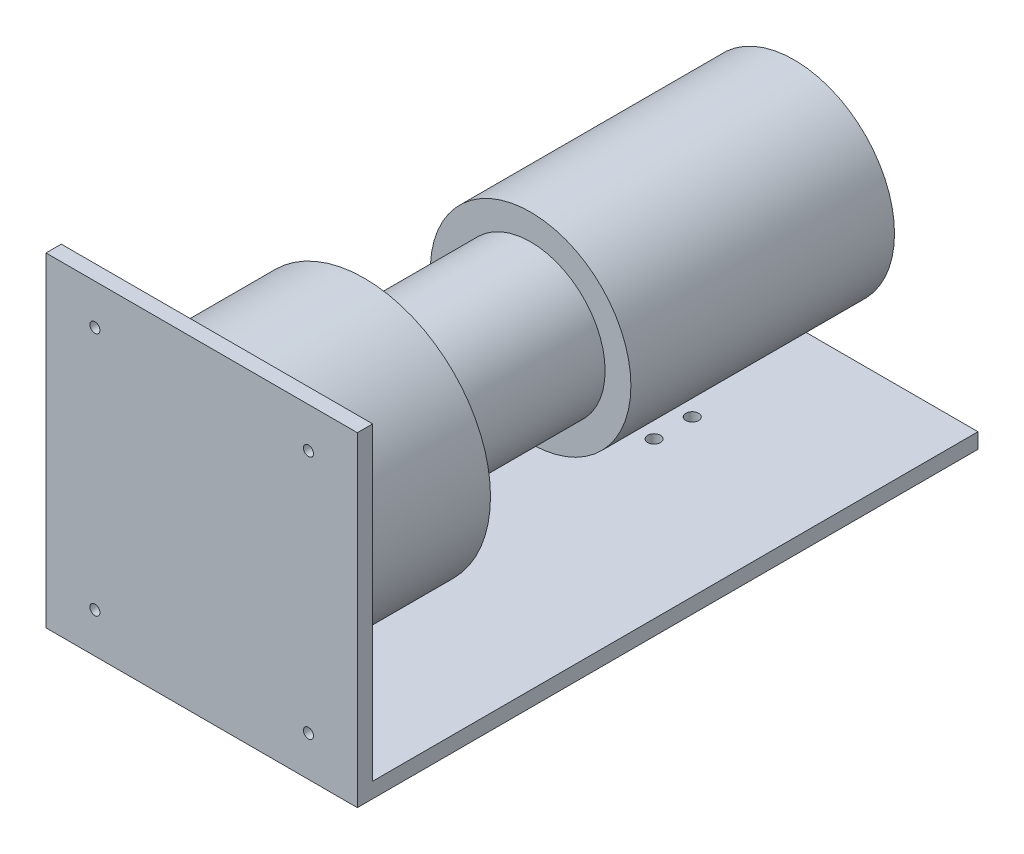
ISO-10303-21;
HEADER;
FILE_DESCRIPTION(('STEP AP214'),'2;1');
FILE_NAME('part.step','',(''),(''),'','','');
FILE_SCHEMA(('AUTOMOTIVE_DESIGN { 1 0 10303 214 1 1 1 1 }'));
ENDSEC;
DATA;
#1=APPLICATION_CONTEXT('core data for automotive mechanical design processes');
#2=APPLICATION_PROTOCOL_DEFINITION('international standard','automotive_design',2000,#1);
#3=PRODUCT_CONTEXT('',#1,'mechanical');
#4=PRODUCT('Part','Part','',(#3));
#5=PRODUCT_RELATED_PRODUCT_CATEGORY('part','',(#4));
#6=PRODUCT_DEFINITION_FORMATION('','',#4);
#7=PRODUCT_DEFINITION_CONTEXT('part definition',#1,'design');
#8=PRODUCT_DEFINITION('design','',#6,#7);
#9=PRODUCT_DEFINITION_SHAPE('','',#8);
#10=(LENGTH_UNIT() NAMED_UNIT(*) SI_UNIT(.MILLI.,.METRE.));
#11=(NAMED_UNIT(*) PLANE_ANGLE_UNIT() SI_UNIT($,.RADIAN.));
#12=(NAMED_UNIT(*) SI_UNIT($,.STERADIAN.) SOLID_ANGLE_UNIT());
#13=UNCERTAINTY_MEASURE_WITH_UNIT(LENGTH_MEASURE(1.E-05),#10,'distance_accuracy_value','');
#14=(GEOMETRIC_REPRESENTATION_CONTEXT(3) GLOBAL_UNCERTAINTY_ASSIGNED_CONTEXT((#13)) GLOBAL_UNIT_ASSIGNED_CONTEXT((#10,
#11,#12)) REPRESENTATION_CONTEXT('',''));
#15=CARTESIAN_POINT('',(0.,0.,0.));
#16=DIRECTION('',(0.,0.,1.));
#17=DIRECTION('',(1.,0.,0.));
#18=AXIS2_PLACEMENT_3D('',#15,#16,#17);
#19=CARTESIAN_POINT('',(0.,0.,80.));
#20=DIRECTION('',(0.,0.,-1.));
#21=DIRECTION('',(-1.,0.,0.));
#22=AXIS2_PLACEMENT_3D('',#19,#20,#21);
#23=CYLINDRICAL_SURFACE('',#22,66.);
#24=CARTESIAN_POINT('',(0.,0.,0.));
#25=DIRECTION('',(0.,0.,1.));
#26=DIRECTION('',(1.,0.,0.));
#27=AXIS2_PLACEMENT_3D('',#24,#25,#26);
#28=CIRCLE('',#27,66.);
#29=CARTESIAN_POINT('',(66.,0.,0.));
#30=VERTEX_POINT('',#29);
#31=EDGE_CURVE('E46',#30,#30,#28,.T.);
#32=ORIENTED_EDGE('',*,*,#31,.T.);
#33=EDGE_LOOP('',(#32));
#34=FACE_BOUND('',#33,.T.);
#35=CARTESIAN_POINT('',(0.,0.,77.1921931565536));
#36=DIRECTION('',(0.,0.,1.));
#37=DIRECTION('',(0.,-1.,0.));
#38=AXIS2_PLACEMENT_3D('',#35,#36,#37);
#39=CIRCLE('',#38,66.);
#40=CARTESIAN_POINT('',(0.,-66.,77.1921931565536));
#41=VERTEX_POINT('',#40);
#42=EDGE_CURVE('E11',#41,#41,#39,.T.);
#43=ORIENTED_EDGE('',*,*,#42,.F.);
#44=EDGE_LOOP('',(#43));
#45=FACE_BOUND('',#44,.T.);
#46=ADVANCED_FACE('F37',(#34,#45),#23,.T.);
#47=CARTESIAN_POINT('',(0.,0.,0.));
#48=DIRECTION('',(0.,0.,1.));
#49=DIRECTION('',(1.,0.,0.));
#50=AXIS2_PLACEMENT_3D('',#47,#48,#49);
#51=PLANE('',#50);
#52=CARTESIAN_POINT('',(0.,0.,0.));
#53=DIRECTION('',(0.,0.,1.));
#54=DIRECTION('',(1.,0.,0.));
#55=AXIS2_PLACEMENT_3D('',#52,#53,#54);
#56=CIRCLE('',#55,39.);
#57=CARTESIAN_POINT('',(39.,0.,0.));
#58=VERTEX_POINT('',#57);
#59=EDGE_CURVE('E153',#58,#58,#56,.T.);
#60=ORIENTED_EDGE('',*,*,#59,.T.);
#61=EDGE_LOOP('',(#60));
#62=FACE_BOUND('',#61,.T.);
#63=ORIENTED_EDGE('',*,*,#31,.F.);
#64=EDGE_LOOP('',(#63));
#65=FACE_BOUND('',#64,.T.);
#66=ADVANCED_FACE('F208',(#62,#65),#51,.F.);
#67=CARTESIAN_POINT('',(0.,0.,-87.));
#68=DIRECTION('',(0.,0.,1.));
#69=DIRECTION('',(1.,0.,0.));
#70=AXIS2_PLACEMENT_3D('',#67,#68,#69);
#71=CYLINDRICAL_SURFACE('',#70,39.);
#72=CARTESIAN_POINT('',(0.,0.,-87.));
#73=DIRECTION('',(0.,0.,1.));
#74=DIRECTION('',(1.,0.,0.));
#75=AXIS2_PLACEMENT_3D('',#72,#73,#74);
#76=CIRCLE('',#75,39.);
#77=CARTESIAN_POINT('',(39.,0.,-87.));
#78=VERTEX_POINT('',#77);
#79=EDGE_CURVE('E148',#78,#78,#76,.T.);
#80=ORIENTED_EDGE('',*,*,#79,.T.);
#81=EDGE_LOOP('',(#80));
#82=FACE_BOUND('',#81,.T.);
#83=ORIENTED_EDGE('',*,*,#59,.F.);
#84=EDGE_LOOP('',(#83));
#85=FACE_BOUND('',#84,.T.);
#86=ADVANCED_FACE('F213',(#82,#85),#71,.T.);
#87=CARTESIAN_POINT('',(0.,0.,-225.));
#88=DIRECTION('',(0.,0.,1.));
#89=DIRECTION('',(1.,0.,0.));
#90=AXIS2_PLACEMENT_3D('',#87,#88,#89);
#91=CYLINDRICAL_SURFACE('',#90,52.5);
#92=CARTESIAN_POINT('',(0.,0.,-225.));
#93=DIRECTION('',(0.,0.,1.));
#94=DIRECTION('',(1.,0.,0.));
#95=AXIS2_PLACEMENT_3D('',#92,#93,#94);
#96=CIRCLE('',#95,52.5);
#97=CARTESIAN_POINT('',(52.5,0.,-225.));
#98=VERTEX_POINT('',#97);
#99=EDGE_CURVE('E145',#98,#98,#96,.T.);
#100=ORIENTED_EDGE('',*,*,#99,.T.);
#101=EDGE_LOOP('',(#100));
#102=FACE_BOUND('',#101,.T.);
#103=CARTESIAN_POINT('',(0.,0.,-87.));
#104=DIRECTION('',(0.,0.,1.));
#105=DIRECTION('',(1.,0.,0.));
#106=AXIS2_PLACEMENT_3D('',#103,#104,#105);
#107=CIRCLE('',#106,52.5);
#108=CARTESIAN_POINT('',(52.5,0.,-87.));
#109=VERTEX_POINT('',#108);
#110=EDGE_CURVE('E144',#109,#109,#107,.T.);
#111=ORIENTED_EDGE('',*,*,#110,.F.);
#112=EDGE_LOOP('',(#111));
#113=FACE_BOUND('',#112,.T.);
#114=ADVANCED_FACE('F235',(#102,#113),#91,.T.);
#115=CARTESIAN_POINT('',(0.,0.,-225.));
#116=DIRECTION('',(0.,0.,1.));
#117=DIRECTION('',(1.,0.,0.));
#118=AXIS2_PLACEMENT_3D('',#115,#116,#117);
#119=PLANE('',#118);
#120=ORIENTED_EDGE('',*,*,#99,.F.);
#121=EDGE_LOOP('',(#120));
#122=FACE_BOUND('',#121,.T.);
#123=ADVANCED_FACE('F228',(#122),#119,.F.);
#124=CARTESIAN_POINT('',(0.,0.,-87.));
#125=DIRECTION('',(0.,0.,1.));
#126=DIRECTION('',(1.,0.,0.));
#127=AXIS2_PLACEMENT_3D('',#124,#125,#126);
#128=PLANE('',#127);
#129=ORIENTED_EDGE('',*,*,#79,.F.);
#130=EDGE_LOOP('',(#129));
#131=FACE_BOUND('',#130,.T.);
#132=ORIENTED_EDGE('',*,*,#110,.T.);
#133=EDGE_LOOP('',(#132));
#134=FACE_BOUND('',#133,.T.);
#135=ADVANCED_FACE('F220',(#131,#134),#128,.T.);
#136=CARTESIAN_POINT('',(81.5,-82.6989064125037,77.1921931565536));
#137=DIRECTION('',(0.,0.,1.));
#138=DIRECTION('',(0.,-1.,0.));
#139=AXIS2_PLACEMENT_3D('',#136,#137,#138);
#140=PLANE('',#139);
#141=CARTESIAN_POINT('',(-55.9,-69.6989064125036,77.1921931565536));
#142=DIRECTION('',(0.,0.,1.));
#143=DIRECTION('',(0.,-1.,0.));
#144=AXIS2_PLACEMENT_3D('',#141,#142,#143);
#145=CIRCLE('',#144,2.625);
#146=CARTESIAN_POINT('',(-55.9,-72.3239064125036,77.1921931565536));
#147=VERTEX_POINT('',#146);
#148=EDGE_CURVE('E128',#147,#147,#145,.T.);
#149=ORIENTED_EDGE('',*,*,#148,.T.);
#150=EDGE_LOOP('',(#149));
#151=FACE_BOUND('',#150,.T.);
#152=CARTESIAN_POINT('',(55.9,-69.6989064125036,77.1921931565536));
#153=DIRECTION('',(0.,0.,1.));
#154=DIRECTION('',(0.,-1.,0.));
#155=AXIS2_PLACEMENT_3D('',#152,#153,#154);
#156=CIRCLE('',#155,2.625);
#157=CARTESIAN_POINT('',(55.9,-72.3239064125036,77.1921931565536));
#158=VERTEX_POINT('',#157);
#159=EDGE_CURVE('E168',#158,#158,#156,.T.);
#160=ORIENTED_EDGE('',*,*,#159,.T.);
#161=EDGE_LOOP('',(#160));
#162=FACE_BOUND('',#161,.T.);
#163=CARTESIAN_POINT('',(55.9,58.3010935874964,77.1921931565536));
#164=DIRECTION('',(0.,0.,1.));
#165=DIRECTION('',(0.,-1.,0.));
#166=AXIS2_PLACEMENT_3D('',#163,#164,#165);
#167=CIRCLE('',#166,2.625);
#168=CARTESIAN_POINT('',(55.9,55.6760935874964,77.1921931565536));
#169=VERTEX_POINT('',#168);
#170=EDGE_CURVE('E165',#169,#169,#167,.T.);
#171=ORIENTED_EDGE('',*,*,#170,.T.);
#172=EDGE_LOOP('',(#171));
#173=FACE_BOUND('',#172,.T.);
#174=CARTESIAN_POINT('',(-55.9,58.3010935874964,77.1921931565536));
#175=DIRECTION('',(0.,0.,1.));
#176=DIRECTION('',(0.,-1.,0.));
#177=AXIS2_PLACEMENT_3D('',#174,#175,#176);
#178=CIRCLE('',#177,2.625);
#179=CARTESIAN_POINT('',(-55.9,55.6760935874964,77.1921931565536));
#180=VERTEX_POINT('',#179);
#181=EDGE_CURVE('E161',#180,#180,#178,.T.);
#182=ORIENTED_EDGE('',*,*,#181,.T.);
#183=EDGE_LOOP('',(#182));
#184=FACE_BOUND('',#183,.T.);
#185=ORIENTED_EDGE('',*,*,#42,.T.);
#186=EDGE_LOOP('',(#185));
#187=FACE_BOUND('',#186,.T.);
#188=DIRECTION('',(0.,1.,0.));
#189=VECTOR('',#188,1.);
#190=CARTESIAN_POINT('',(-81.5,-82.6989064125037,77.1921931565536));
#191=LINE('',#190,#189);
#192=CARTESIAN_POINT('',(-81.5,-82.6989064125037,77.1921931565536));
#193=VERTEX_POINT('',#192);
#194=CARTESIAN_POINT('',(-81.5,79.3010935874964,77.1921931565536));
#195=VERTEX_POINT('',#194);
#196=EDGE_CURVE('E124',#193,#195,#191,.T.);
#197=ORIENTED_EDGE('',*,*,#196,.T.);
#198=DIRECTION('',(-1.,0.,0.));
#199=VECTOR('',#198,1.);
#200=CARTESIAN_POINT('',(81.5,79.3010935874964,77.1921931565536));
#201=LINE('',#200,#199);
#202=CARTESIAN_POINT('',(81.5,79.3010935874964,77.1921931565536));
#203=VERTEX_POINT('',#202);
#204=EDGE_CURVE('E142',#203,#195,#201,.T.);
#205=ORIENTED_EDGE('',*,*,#204,.F.);
#206=DIRECTION('',(0.,1.,0.));
#207=VECTOR('',#206,1.);
#208=CARTESIAN_POINT('',(81.5,-82.6989064125037,77.1921931565536));
#209=LINE('',#208,#207);
#210=CARTESIAN_POINT('',(81.5,-82.6989064125037,77.1921931565536));
#211=VERTEX_POINT('',#210);
#212=EDGE_CURVE('E135',#211,#203,#209,.T.);
#213=ORIENTED_EDGE('',*,*,#212,.F.);
#214=DIRECTION('',(-1.,0.,0.));
#215=VECTOR('',#214,1.);
#216=CARTESIAN_POINT('',(81.5,-82.6989064125037,77.1921931565536));
#217=LINE('',#216,#215);
#218=EDGE_CURVE('E120',#211,#193,#217,.T.);
#219=ORIENTED_EDGE('',*,*,#218,.T.);
#220=EDGE_LOOP('',(#197,#205,#213,#219));
#221=FACE_BOUND('',#220,.T.);
#222=ADVANCED_FACE('F193',(#151,#162,#173,#184,#187,#221),#140,.F.);
#223=CARTESIAN_POINT('',(81.5,79.3010935874964,77.1921931565536));
#224=DIRECTION('',(0.,-1.,0.));
#225=DIRECTION('',(0.,0.,-1.));
#226=AXIS2_PLACEMENT_3D('',#223,#224,#225);
#227=PLANE('',#226);
#228=DIRECTION('',(0.,0.,1.));
#229=VECTOR('',#228,1.);
#230=CARTESIAN_POINT('',(-81.5,79.3010935874964,77.1921931565536));
#231=LINE('',#230,#229);
#232=CARTESIAN_POINT('',(-81.5,79.3010935874964,85.1921931565536));
#233=VERTEX_POINT('',#232);
#234=EDGE_CURVE('E127',#195,#233,#231,.T.);
#235=ORIENTED_EDGE('',*,*,#234,.T.);
#236=DIRECTION('',(-1.,0.,0.));
#237=VECTOR('',#236,1.);
#238=CARTESIAN_POINT('',(81.5,79.3010935874964,85.1921931565536));
#239=LINE('',#238,#237);
#240=CARTESIAN_POINT('',(81.5,79.3010935874964,85.1921931565536));
#241=VERTEX_POINT('',#240);
#242=EDGE_CURVE('E139',#241,#233,#239,.T.);
#243=ORIENTED_EDGE('',*,*,#242,.F.);
#244=DIRECTION('',(0.,0.,1.));
#245=VECTOR('',#244,1.);
#246=CARTESIAN_POINT('',(81.5,79.3010935874964,77.1921931565536));
#247=LINE('',#246,#245);
#248=EDGE_CURVE('E93',#203,#241,#247,.T.);
#249=ORIENTED_EDGE('',*,*,#248,.F.);
#250=ORIENTED_EDGE('',*,*,#204,.T.);
#251=EDGE_LOOP('',(#235,#243,#249,#250));
#252=FACE_BOUND('',#251,.T.);
#253=ADVANCED_FACE('F185',(#252),#227,.F.);
#254=CARTESIAN_POINT('',(81.5,79.3010935874964,85.1921931565536));
#255=DIRECTION('',(0.,0.,-1.));
#256=DIRECTION('',(0.,1.,0.));
#257=AXIS2_PLACEMENT_3D('',#254,#255,#256);
#258=PLANE('',#257);
#259=CARTESIAN_POINT('',(-55.9,-69.6989064125036,85.1921931565536));
#260=DIRECTION('',(0.,0.,-1.));
#261=DIRECTION('',(0.,1.,0.));
#262=AXIS2_PLACEMENT_3D('',#259,#260,#261);
#263=CIRCLE('',#262,2.625);
#264=CARTESIAN_POINT('',(-55.9,-67.0739064125036,85.1921931565536));
#265=VERTEX_POINT('',#264);
#266=EDGE_CURVE('E40',#265,#265,#263,.T.);
#267=ORIENTED_EDGE('',*,*,#266,.T.);
#268=EDGE_LOOP('',(#267));
#269=FACE_BOUND('',#268,.T.);
#270=CARTESIAN_POINT('',(55.9,-69.6989064125036,85.1921931565536));
#271=DIRECTION('',(0.,0.,-1.));
#272=DIRECTION('',(0.,1.,0.));
#273=AXIS2_PLACEMENT_3D('',#270,#271,#272);
#274=CIRCLE('',#273,2.625);
#275=CARTESIAN_POINT('',(55.9,-67.0739064125036,85.1921931565536));
#276=VERTEX_POINT('',#275);
#277=EDGE_CURVE('E166',#276,#276,#274,.T.);
#278=ORIENTED_EDGE('',*,*,#277,.T.);
#279=EDGE_LOOP('',(#278));
#280=FACE_BOUND('',#279,.T.);
#281=CARTESIAN_POINT('',(55.9,58.3010935874964,85.1921931565536));
#282=DIRECTION('',(0.,0.,-1.));
#283=DIRECTION('',(0.,1.,0.));
#284=AXIS2_PLACEMENT_3D('',#281,#282,#283);
#285=CIRCLE('',#284,2.625);
#286=CARTESIAN_POINT('',(55.9,60.9260935874964,85.1921931565536));
#287=VERTEX_POINT('',#286);
#288=EDGE_CURVE('E163',#287,#287,#285,.T.);
#289=ORIENTED_EDGE('',*,*,#288,.T.);
#290=EDGE_LOOP('',(#289));
#291=FACE_BOUND('',#290,.T.);
#292=CARTESIAN_POINT('',(-55.9,58.3010935874964,85.1921931565536));
#293=DIRECTION('',(0.,0.,-1.));
#294=DIRECTION('',(0.,1.,0.));
#295=AXIS2_PLACEMENT_3D('',#292,#293,#294);
#296=CIRCLE('',#295,2.625);
#297=CARTESIAN_POINT('',(-55.9,60.9260935874964,85.1921931565536));
#298=VERTEX_POINT('',#297);
#299=EDGE_CURVE('E158',#298,#298,#296,.T.);
#300=ORIENTED_EDGE('',*,*,#299,.T.);
#301=EDGE_LOOP('',(#300));
#302=FACE_BOUND('',#301,.T.);
#303=DIRECTION('',(0.,-1.,0.));
#304=VECTOR('',#303,1.);
#305=CARTESIAN_POINT('',(-81.5,79.3010935874964,85.1921931565536));
#306=LINE('',#305,#304);
#307=CARTESIAN_POINT('',(-81.5,-90.6989064125036,85.1921931565536));
#308=VERTEX_POINT('',#307);
#309=EDGE_CURVE('E130',#233,#308,#306,.T.);
#310=ORIENTED_EDGE('',*,*,#309,.T.);
#311=DIRECTION('',(-1.,0.,0.));
#312=VECTOR('',#311,1.);
#313=CARTESIAN_POINT('',(81.5,-90.6989064125036,85.1921931565536));
#314=LINE('',#313,#312);
#315=CARTESIAN_POINT('',(81.5,-90.6989064125036,85.1921931565536));
#316=VERTEX_POINT('',#315);
#317=EDGE_CURVE('E115',#316,#308,#314,.T.);
#318=ORIENTED_EDGE('',*,*,#317,.F.);
#319=DIRECTION('',(0.,-1.,0.));
#320=VECTOR('',#319,1.);
#321=CARTESIAN_POINT('',(81.5,79.3010935874964,85.1921931565536));
#322=LINE('',#321,#320);
#323=EDGE_CURVE('E106',#241,#316,#322,.T.);
#324=ORIENTED_EDGE('',*,*,#323,.F.);
#325=ORIENTED_EDGE('',*,*,#242,.T.);
#326=EDGE_LOOP('',(#310,#318,#324,#325));
#327=FACE_BOUND('',#326,.T.);
#328=ADVANCED_FACE('F188',(#269,#280,#291,#302,#327),#258,.F.);
#329=CARTESIAN_POINT('',(81.5,-90.6989064125036,85.1921931565536));
#330=DIRECTION('',(0.,1.,0.));
#331=DIRECTION('',(0.,0.,1.));
#332=AXIS2_PLACEMENT_3D('',#329,#330,#331);
#333=PLANE('',#332);
#334=CARTESIAN_POINT('',(-1.30828681222091E-12,-90.6989064125197,-151.628034649166));
#335=DIRECTION('',(0.,1.,0.));
#336=DIRECTION('',(0.,0.,1.));
#337=AXIS2_PLACEMENT_3D('',#334,#335,#336);
#338=CIRCLE('',#337,3.34999999999998);
#339=CARTESIAN_POINT('',(-1.30828681222091E-12,-90.6989064125197,-148.278034649166));
#340=VERTEX_POINT('',#339);
#341=EDGE_CURVE('E162',#340,#340,#338,.T.);
#342=ORIENTED_EDGE('',*,*,#341,.T.);
#343=EDGE_LOOP('',(#342));
#344=FACE_BOUND('',#343,.T.);
#345=CARTESIAN_POINT('',(-1.30828681222091E-12,-90.6989064125197,-171.628034649166));
#346=DIRECTION('',(0.,1.,0.));
#347=DIRECTION('',(0.,0.,1.));
#348=AXIS2_PLACEMENT_3D('',#345,#346,#347);
#349=CIRCLE('',#348,3.34999999999998);
#350=CARTESIAN_POINT('',(-1.30828681222091E-12,-90.6989064125197,-168.278034649166));
#351=VERTEX_POINT('',#350);
#352=EDGE_CURVE('E422',#351,#351,#349,.T.);
#353=ORIENTED_EDGE('',*,*,#352,.T.);
#354=EDGE_LOOP('',(#353));
#355=FACE_BOUND('',#354,.T.);
#356=DIRECTION('',(0.,0.,-1.));
#357=VECTOR('',#356,1.);
#358=CARTESIAN_POINT('',(-81.5,-90.6989064125036,85.1921931565536));
#359=LINE('',#358,#357);
#360=CARTESIAN_POINT('',(-81.5,-90.6989064125036,-239.70794933244));
#361=VERTEX_POINT('',#360);
#362=EDGE_CURVE('E114',#308,#361,#359,.T.);
#363=ORIENTED_EDGE('',*,*,#362,.T.);
#364=DIRECTION('',(-1.,0.,0.));
#365=VECTOR('',#364,1.);
#366=CARTESIAN_POINT('',(81.5,-90.6989064125036,-239.70794933244));
#367=LINE('',#366,#365);
#368=CARTESIAN_POINT('',(81.5,-90.6989064125036,-239.70794933244));
#369=VERTEX_POINT('',#368);
#370=EDGE_CURVE('E111',#369,#361,#367,.T.);
#371=ORIENTED_EDGE('',*,*,#370,.F.);
#372=DIRECTION('',(0.,0.,-1.));
#373=VECTOR('',#372,1.);
#374=CARTESIAN_POINT('',(81.5,-90.6989064125036,85.1921931565536));
#375=LINE('',#374,#373);
#376=EDGE_CURVE('E100',#316,#369,#375,.T.);
#377=ORIENTED_EDGE('',*,*,#376,.F.);
#378=ORIENTED_EDGE('',*,*,#317,.T.);
#379=EDGE_LOOP('',(#363,#371,#377,#378));
#380=FACE_BOUND('',#379,.T.);
#381=ADVANCED_FACE('F112',(#344,#355,#380),#333,.F.);
#382=CARTESIAN_POINT('',(81.5,-90.6989064125036,-239.70794933244));
#383=DIRECTION('',(0.,0.,1.));
#384=DIRECTION('',(1.,0.,0.));
#385=AXIS2_PLACEMENT_3D('',#382,#383,#384);
#386=PLANE('',#385);
#387=DIRECTION('',(0.,1.,0.));
#388=VECTOR('',#387,1.);
#389=CARTESIAN_POINT('',(-81.5,-90.6989064125036,-239.70794933244));
#390=LINE('',#389,#388);
#391=CARTESIAN_POINT('',(-81.5,-82.6989064125036,-239.70794933244));
#392=VERTEX_POINT('',#391);
#393=EDGE_CURVE('E78',#361,#392,#390,.T.);
#394=ORIENTED_EDGE('',*,*,#393,.T.);
#395=DIRECTION('',(-1.,0.,0.));
#396=VECTOR('',#395,1.);
#397=CARTESIAN_POINT('',(81.5,-82.6989064125036,-239.70794933244));
#398=LINE('',#397,#396);
#399=CARTESIAN_POINT('',(81.5,-82.6989064125036,-239.70794933244));
#400=VERTEX_POINT('',#399);
#401=EDGE_CURVE('E116',#400,#392,#398,.T.);
#402=ORIENTED_EDGE('',*,*,#401,.F.);
#403=DIRECTION('',(0.,1.,0.));
#404=VECTOR('',#403,1.);
#405=CARTESIAN_POINT('',(81.5,-90.6989064125036,-239.70794933244));
#406=LINE('',#405,#404);
#407=EDGE_CURVE('E104',#369,#400,#406,.T.);
#408=ORIENTED_EDGE('',*,*,#407,.F.);
#409=ORIENTED_EDGE('',*,*,#370,.T.);
#410=EDGE_LOOP('',(#394,#402,#408,#409));
#411=FACE_BOUND('',#410,.T.);
#412=ADVANCED_FACE('F118',(#411),#386,.F.);
#413=CARTESIAN_POINT('',(81.5,-82.6989064125036,-239.70794933244));
#414=DIRECTION('',(0.,-1.,0.));
#415=DIRECTION('',(0.,0.,-1.));
#416=AXIS2_PLACEMENT_3D('',#413,#414,#415);
#417=PLANE('',#416);
#418=CARTESIAN_POINT('',(0.,-82.6989064125036,-151.628034649166));
#419=DIRECTION('',(0.,1.,0.));
#420=DIRECTION('',(0.,0.,1.));
#421=AXIS2_PLACEMENT_3D('',#418,#419,#420);
#422=CIRCLE('',#421,3.34999999999998);
#423=CARTESIAN_POINT('',(0.,-82.6989064125036,-148.278034649166));
#424=VERTEX_POINT('',#423);
#425=EDGE_CURVE('E417',#424,#424,#422,.T.);
#426=ORIENTED_EDGE('',*,*,#425,.F.);
#427=EDGE_LOOP('',(#426));
#428=FACE_BOUND('',#427,.T.);
#429=CARTESIAN_POINT('',(0.,-82.6989064125036,-171.628034649166));
#430=DIRECTION('',(0.,1.,0.));
#431=DIRECTION('',(0.,0.,1.));
#432=AXIS2_PLACEMENT_3D('',#429,#430,#431);
#433=CIRCLE('',#432,3.34999999999998);
#434=CARTESIAN_POINT('',(0.,-82.6989064125036,-168.278034649166));
#435=VERTEX_POINT('',#434);
#436=EDGE_CURVE('E418',#435,#435,#433,.T.);
#437=ORIENTED_EDGE('',*,*,#436,.F.);
#438=EDGE_LOOP('',(#437));
#439=FACE_BOUND('',#438,.T.);
#440=DIRECTION('',(0.,0.,1.));
#441=VECTOR('',#440,1.);
#442=CARTESIAN_POINT('',(-81.5,-82.6989064125036,-239.70794933244));
#443=LINE('',#442,#441);
#444=EDGE_CURVE('E84',#392,#193,#443,.T.);
#445=ORIENTED_EDGE('',*,*,#444,.T.);
#446=ORIENTED_EDGE('',*,*,#218,.F.);
#447=DIRECTION('',(0.,0.,1.));
#448=VECTOR('',#447,1.);
#449=CARTESIAN_POINT('',(81.5,-82.6989064125036,-239.70794933244));
#450=LINE('',#449,#448);
#451=EDGE_CURVE('E55',#400,#211,#450,.T.);
#452=ORIENTED_EDGE('',*,*,#451,.F.);
#453=ORIENTED_EDGE('',*,*,#401,.T.);
#454=EDGE_LOOP('',(#445,#446,#452,#453));
#455=FACE_BOUND('',#454,.T.);
#456=ADVANCED_FACE('F194',(#428,#439,#455),#417,.F.);
#457=CARTESIAN_POINT('',(81.5,0.,0.));
#458=DIRECTION('',(1.,0.,0.));
#459=DIRECTION('',(0.,0.,-1.));
#460=AXIS2_PLACEMENT_3D('',#457,#458,#459);
#461=PLANE('',#460);
#462=ORIENTED_EDGE('',*,*,#212,.T.);
#463=ORIENTED_EDGE('',*,*,#248,.T.);
#464=ORIENTED_EDGE('',*,*,#323,.T.);
#465=ORIENTED_EDGE('',*,*,#376,.T.);
#466=ORIENTED_EDGE('',*,*,#407,.T.);
#467=ORIENTED_EDGE('',*,*,#451,.T.);
#468=EDGE_LOOP('',(#462,#463,#464,#465,#466,#467));
#469=FACE_BOUND('',#468,.T.);
#470=ADVANCED_FACE('F102',(#469),#461,.T.);
#471=CARTESIAN_POINT('',(-81.5,0.,0.));
#472=DIRECTION('',(1.,0.,0.));
#473=DIRECTION('',(0.,0.,-1.));
#474=AXIS2_PLACEMENT_3D('',#471,#472,#473);
#475=PLANE('',#474);
#476=ORIENTED_EDGE('',*,*,#196,.F.);
#477=ORIENTED_EDGE('',*,*,#444,.F.);
#478=ORIENTED_EDGE('',*,*,#393,.F.);
#479=ORIENTED_EDGE('',*,*,#362,.F.);
#480=ORIENTED_EDGE('',*,*,#309,.F.);
#481=ORIENTED_EDGE('',*,*,#234,.F.);
#482=EDGE_LOOP('',(#476,#477,#478,#479,#480,#481));
#483=FACE_BOUND('',#482,.T.);
#484=ADVANCED_FACE('F191',(#483),#475,.F.);
#485=CARTESIAN_POINT('',(-55.9,58.3010935874964,3.69));
#486=DIRECTION('',(0.,0.,1.));
#487=DIRECTION('',(1.,0.,0.));
#488=AXIS2_PLACEMENT_3D('',#485,#486,#487);
#489=CYLINDRICAL_SURFACE('',#488,2.625);
#490=ORIENTED_EDGE('',*,*,#299,.F.);
#491=EDGE_LOOP('',(#490));
#492=FACE_BOUND('',#491,.T.);
#493=ORIENTED_EDGE('',*,*,#181,.F.);
#494=EDGE_LOOP('',(#493));
#495=FACE_BOUND('',#494,.T.);
#496=ADVANCED_FACE('F307',(#492,#495),#489,.F.);
#497=CARTESIAN_POINT('',(55.9,58.3010935874964,3.69));
#498=DIRECTION('',(0.,0.,1.));
#499=DIRECTION('',(1.,0.,0.));
#500=AXIS2_PLACEMENT_3D('',#497,#498,#499);
#501=CYLINDRICAL_SURFACE('',#500,2.625);
#502=ORIENTED_EDGE('',*,*,#288,.F.);
#503=EDGE_LOOP('',(#502));
#504=FACE_BOUND('',#503,.T.);
#505=ORIENTED_EDGE('',*,*,#170,.F.);
#506=EDGE_LOOP('',(#505));
#507=FACE_BOUND('',#506,.T.);
#508=ADVANCED_FACE('F327',(#504,#507),#501,.F.);
#509=CARTESIAN_POINT('',(55.9,-69.6989064125036,3.69));
#510=DIRECTION('',(0.,0.,1.));
#511=DIRECTION('',(1.,0.,0.));
#512=AXIS2_PLACEMENT_3D('',#509,#510,#511);
#513=CYLINDRICAL_SURFACE('',#512,2.625);
#514=ORIENTED_EDGE('',*,*,#277,.F.);
#515=EDGE_LOOP('',(#514));
#516=FACE_BOUND('',#515,.T.);
#517=ORIENTED_EDGE('',*,*,#159,.F.);
#518=EDGE_LOOP('',(#517));
#519=FACE_BOUND('',#518,.T.);
#520=ADVANCED_FACE('F338',(#516,#519),#513,.F.);
#521=CARTESIAN_POINT('',(-55.9,-69.6989064125036,3.69));
#522=DIRECTION('',(0.,0.,1.));
#523=DIRECTION('',(1.,0.,0.));
#524=AXIS2_PLACEMENT_3D('',#521,#522,#523);
#525=CYLINDRICAL_SURFACE('',#524,2.625);
#526=ORIENTED_EDGE('',*,*,#266,.F.);
#527=EDGE_LOOP('',(#526));
#528=FACE_BOUND('',#527,.T.);
#529=ORIENTED_EDGE('',*,*,#148,.F.);
#530=EDGE_LOOP('',(#529));
#531=FACE_BOUND('',#530,.T.);
#532=ADVANCED_FACE('F349',(#528,#531),#525,.F.);
#533=CARTESIAN_POINT('',(-1.30828681222091E-12,-90.6989064125197,-171.628034649166));
#534=DIRECTION('',(1.63535851527286E-13,1.,0.));
#535=DIRECTION('',(-1.,1.63535851527286E-13,0.));
#536=AXIS2_PLACEMENT_3D('',#533,#534,#535);
#537=CYLINDRICAL_SURFACE('',#536,3.34999999999998);
#538=ORIENTED_EDGE('',*,*,#352,.F.);
#539=EDGE_LOOP('',(#538));
#540=FACE_BOUND('',#539,.T.);
#541=ORIENTED_EDGE('',*,*,#436,.T.);
#542=EDGE_LOOP('',(#541));
#543=FACE_BOUND('',#542,.T.);
#544=ADVANCED_FACE('F360',(#540,#543),#537,.F.);
#545=CARTESIAN_POINT('',(-1.30828681222091E-12,-90.6989064125197,-151.628034649166));
#546=DIRECTION('',(1.63535851527286E-13,1.,0.));
#547=DIRECTION('',(-1.,1.63535851527286E-13,0.));
#548=AXIS2_PLACEMENT_3D('',#545,#546,#547);
#549=CYLINDRICAL_SURFACE('',#548,3.34999999999998);
#550=ORIENTED_EDGE('',*,*,#341,.F.);
#551=EDGE_LOOP('',(#550));
#552=FACE_BOUND('',#551,.T.);
#553=ORIENTED_EDGE('',*,*,#425,.T.);
#554=EDGE_LOOP('',(#553));
#555=FACE_BOUND('',#554,.T.);
#556=ADVANCED_FACE('F383',(#552,#555),#549,.F.);
#557=CLOSED_SHELL('',(#46,#66,#86,#114,#123,#135,#222,#253,#328,#381,#412,#456,#470,#484,#496,
#508,#520,#532,#544,#556));
#558=MANIFOLD_SOLID_BREP('B2',#557);
#559=ADVANCED_BREP_SHAPE_REPRESENTATION('',(#18,#558),#14);
#560=SHAPE_DEFINITION_REPRESENTATION(#9,#559);
ENDSEC;
END-ISO-10303-21;
